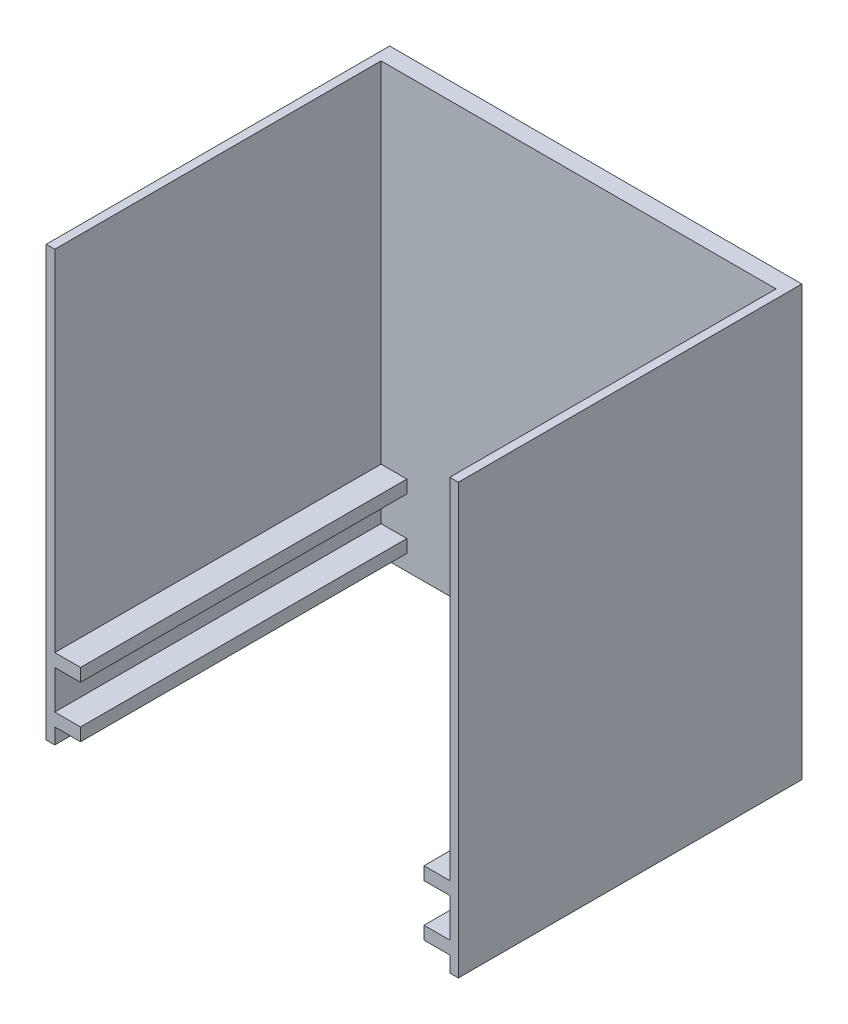
ISO-10303-21;
HEADER;
FILE_DESCRIPTION(('STEP AP214'),'2;1');
FILE_NAME('part.step','',(''),(''),'','','');
FILE_SCHEMA(('AUTOMOTIVE_DESIGN { 1 0 10303 214 1 1 1 1 }'));
ENDSEC;
DATA;
#1=APPLICATION_CONTEXT('core data for automotive mechanical design processes');
#2=APPLICATION_PROTOCOL_DEFINITION('international standard','automotive_design',2000,#1);
#3=PRODUCT_CONTEXT('',#1,'mechanical');
#4=PRODUCT('Part','Part','',(#3));
#5=PRODUCT_RELATED_PRODUCT_CATEGORY('part','',(#4));
#6=PRODUCT_DEFINITION_FORMATION('','',#4);
#7=PRODUCT_DEFINITION_CONTEXT('part definition',#1,'design');
#8=PRODUCT_DEFINITION('design','',#6,#7);
#9=PRODUCT_DEFINITION_SHAPE('','',#8);
#10=(LENGTH_UNIT() NAMED_UNIT(*) SI_UNIT(.MILLI.,.METRE.));
#11=(NAMED_UNIT(*) PLANE_ANGLE_UNIT() SI_UNIT($,.RADIAN.));
#12=(NAMED_UNIT(*) SI_UNIT($,.STERADIAN.) SOLID_ANGLE_UNIT());
#13=UNCERTAINTY_MEASURE_WITH_UNIT(LENGTH_MEASURE(1.E-05),#10,'distance_accuracy_value','');
#14=(GEOMETRIC_REPRESENTATION_CONTEXT(3) GLOBAL_UNCERTAINTY_ASSIGNED_CONTEXT((#13)) GLOBAL_UNIT_ASSIGNED_CONTEXT((#10,
#11,#12)) REPRESENTATION_CONTEXT('',''));
#15=CARTESIAN_POINT('',(0.,0.,0.));
#16=DIRECTION('',(0.,0.,1.));
#17=DIRECTION('',(1.,0.,0.));
#18=AXIS2_PLACEMENT_3D('',#15,#16,#17);
#19=CARTESIAN_POINT('',(0.,0.,40.));
#20=DIRECTION('',(0.,0.,-1.));
#21=DIRECTION('',(-1.,0.,0.));
#22=AXIS2_PLACEMENT_3D('',#19,#20,#21);
#23=PLANE('',#22);
#24=DIRECTION('',(1.,0.,0.));
#25=VECTOR('',#24,1.);
#26=CARTESIAN_POINT('',(-24.,-22.3221146069401,40.));
#27=LINE('',#26,#25);
#28=CARTESIAN_POINT('',(-24.,-22.3221146069401,40.));
#29=VERTEX_POINT('',#28);
#30=CARTESIAN_POINT('',(-23.,-22.3221146069401,40.));
#31=VERTEX_POINT('',#30);
#32=EDGE_CURVE('E439',#29,#31,#27,.T.);
#33=ORIENTED_EDGE('',*,*,#32,.T.);
#34=DIRECTION('',(0.,-1.,0.));
#35=VECTOR('',#34,1.);
#36=CARTESIAN_POINT('',(-23.,0.,40.));
#37=LINE('',#36,#35);
#38=CARTESIAN_POINT('',(-23.,-20.5,40.));
#39=VERTEX_POINT('',#38);
#40=EDGE_CURVE('E362',#39,#31,#37,.T.);
#41=ORIENTED_EDGE('',*,*,#40,.F.);
#42=DIRECTION('',(-1.,0.,0.));
#43=VECTOR('',#42,1.);
#44=CARTESIAN_POINT('',(0.,-20.5,40.));
#45=LINE('',#44,#43);
#46=CARTESIAN_POINT('',(-20.,-20.5,40.));
#47=VERTEX_POINT('',#46);
#48=EDGE_CURVE('E358',#47,#39,#45,.T.);
#49=ORIENTED_EDGE('',*,*,#48,.F.);
#50=DIRECTION('',(0.,-1.,0.));
#51=VECTOR('',#50,1.);
#52=CARTESIAN_POINT('',(-20.,0.,40.));
#53=LINE('',#52,#51);
#54=CARTESIAN_POINT('',(-20.,-19.,40.));
#55=VERTEX_POINT('',#54);
#56=EDGE_CURVE('E354',#55,#47,#53,.T.);
#57=ORIENTED_EDGE('',*,*,#56,.F.);
#58=DIRECTION('',(1.,0.,0.));
#59=VECTOR('',#58,1.);
#60=CARTESIAN_POINT('',(0.,-19.,40.));
#61=LINE('',#60,#59);
#62=CARTESIAN_POINT('',(-23.,-19.,40.));
#63=VERTEX_POINT('',#62);
#64=EDGE_CURVE('E350',#63,#55,#61,.T.);
#65=ORIENTED_EDGE('',*,*,#64,.F.);
#66=DIRECTION('',(0.,-1.,0.));
#67=VECTOR('',#66,1.);
#68=CARTESIAN_POINT('',(-23.,0.,40.));
#69=LINE('',#68,#67);
#70=CARTESIAN_POINT('',(-23.,-14.5,40.));
#71=VERTEX_POINT('',#70);
#72=EDGE_CURVE('E346',#71,#63,#69,.T.);
#73=ORIENTED_EDGE('',*,*,#72,.F.);
#74=DIRECTION('',(-1.,0.,0.));
#75=VECTOR('',#74,1.);
#76=CARTESIAN_POINT('',(0.,-14.5,40.));
#77=LINE('',#76,#75);
#78=CARTESIAN_POINT('',(-20.,-14.5,40.));
#79=VERTEX_POINT('',#78);
#80=EDGE_CURVE('E342',#79,#71,#77,.T.);
#81=ORIENTED_EDGE('',*,*,#80,.F.);
#82=DIRECTION('',(0.,-1.,0.));
#83=VECTOR('',#82,1.);
#84=CARTESIAN_POINT('',(-20.,0.,40.));
#85=LINE('',#84,#83);
#86=CARTESIAN_POINT('',(-20.,-13.,40.));
#87=VERTEX_POINT('',#86);
#88=EDGE_CURVE('E338',#87,#79,#85,.T.);
#89=ORIENTED_EDGE('',*,*,#88,.F.);
#90=DIRECTION('',(1.,0.,0.));
#91=VECTOR('',#90,1.);
#92=CARTESIAN_POINT('',(0.,-13.,40.));
#93=LINE('',#92,#91);
#94=CARTESIAN_POINT('',(-23.,-13.,40.));
#95=VERTEX_POINT('',#94);
#96=EDGE_CURVE('E334',#95,#87,#93,.T.);
#97=ORIENTED_EDGE('',*,*,#96,.F.);
#98=DIRECTION('',(0.,-1.,0.));
#99=VECTOR('',#98,1.);
#100=CARTESIAN_POINT('',(-23.,0.,40.));
#101=LINE('',#100,#99);
#102=CARTESIAN_POINT('',(-23.,27.67788539306,40.));
#103=VERTEX_POINT('',#102);
#104=EDGE_CURVE('E330',#103,#95,#101,.T.);
#105=ORIENTED_EDGE('',*,*,#104,.F.);
#106=DIRECTION('',(-1.,0.,0.));
#107=VECTOR('',#106,1.);
#108=CARTESIAN_POINT('',(-24.,27.6778853930599,40.));
#109=LINE('',#108,#107);
#110=CARTESIAN_POINT('',(-24.,27.6778853930599,40.));
#111=VERTEX_POINT('',#110);
#112=EDGE_CURVE('E433',#103,#111,#109,.T.);
#113=ORIENTED_EDGE('',*,*,#112,.T.);
#114=DIRECTION('',(0.,-1.,0.));
#115=VECTOR('',#114,1.);
#116=CARTESIAN_POINT('',(-24.,-22.3221146069401,40.));
#117=LINE('',#116,#115);
#118=EDGE_CURVE('E436',#111,#29,#117,.T.);
#119=ORIENTED_EDGE('',*,*,#118,.T.);
#120=EDGE_LOOP('',(#33,#41,#49,#57,#65,#73,#81,#89,#97,#105,#113,#119));
#121=FACE_BOUND('',#120,.T.);
#122=ADVANCED_FACE('F39',(#121),#23,.F.);
#123=CARTESIAN_POINT('',(24.,-22.3221146069401,40.));
#124=DIRECTION('',(-1.,0.,0.));
#125=DIRECTION('',(0.,0.,1.));
#126=AXIS2_PLACEMENT_3D('',#123,#124,#125);
#127=PLANE('',#126);
#128=DIRECTION('',(0.,1.,0.));
#129=VECTOR('',#128,1.);
#130=CARTESIAN_POINT('',(24.,-22.3221146069401,0.));
#131=LINE('',#130,#129);
#132=CARTESIAN_POINT('',(24.,-22.3221146069401,0.));
#133=VERTEX_POINT('',#132);
#134=CARTESIAN_POINT('',(24.,27.67788539306,0.));
#135=VERTEX_POINT('',#134);
#136=EDGE_CURVE('E375',#133,#135,#131,.T.);
#137=ORIENTED_EDGE('',*,*,#136,.T.);
#138=DIRECTION('',(0.,0.,-1.));
#139=VECTOR('',#138,1.);
#140=CARTESIAN_POINT('',(24.,27.67788539306,40.));
#141=LINE('',#140,#139);
#142=CARTESIAN_POINT('',(24.,27.67788539306,40.));
#143=VERTEX_POINT('',#142);
#144=EDGE_CURVE('E11',#143,#135,#141,.T.);
#145=ORIENTED_EDGE('',*,*,#144,.F.);
#146=DIRECTION('',(0.,1.,0.));
#147=VECTOR('',#146,1.);
#148=CARTESIAN_POINT('',(24.,-22.3221146069401,40.));
#149=LINE('',#148,#147);
#150=CARTESIAN_POINT('',(24.,-22.3221146069401,40.));
#151=VERTEX_POINT('',#150);
#152=EDGE_CURVE('E430',#151,#143,#149,.T.);
#153=ORIENTED_EDGE('',*,*,#152,.F.);
#154=DIRECTION('',(0.,0.,-1.));
#155=VECTOR('',#154,1.);
#156=CARTESIAN_POINT('',(24.,-22.3221146069401,40.));
#157=LINE('',#156,#155);
#158=EDGE_CURVE('E443',#151,#133,#157,.T.);
#159=ORIENTED_EDGE('',*,*,#158,.T.);
#160=EDGE_LOOP('',(#137,#145,#153,#159));
#161=FACE_BOUND('',#160,.T.);
#162=ADVANCED_FACE('F41',(#161),#127,.F.);
#163=CARTESIAN_POINT('',(-24.,27.6778853930599,40.));
#164=DIRECTION('',(0.,-1.,0.));
#165=DIRECTION('',(1.,0.,0.));
#166=AXIS2_PLACEMENT_3D('',#163,#164,#165);
#167=PLANE('',#166);
#168=ORIENTED_EDGE('',*,*,#112,.F.);
#169=DIRECTION('',(0.,0.,1.));
#170=VECTOR('',#169,1.);
#171=CARTESIAN_POINT('',(-23.,27.67788539306,2.));
#172=LINE('',#171,#170);
#173=CARTESIAN_POINT('',(-23.,27.67788539306,2.));
#174=VERTEX_POINT('',#173);
#175=EDGE_CURVE('E413',#174,#103,#172,.T.);
#176=ORIENTED_EDGE('',*,*,#175,.F.);
#177=DIRECTION('',(-1.,0.,0.));
#178=VECTOR('',#177,1.);
#179=CARTESIAN_POINT('',(0.,27.67788539306,2.));
#180=LINE('',#179,#178);
#181=CARTESIAN_POINT('',(23.,27.67788539306,2.));
#182=VERTEX_POINT('',#181);
#183=EDGE_CURVE('E257',#182,#174,#180,.T.);
#184=ORIENTED_EDGE('',*,*,#183,.F.);
#185=DIRECTION('',(0.,0.,1.));
#186=VECTOR('',#185,1.);
#187=CARTESIAN_POINT('',(23.,27.67788539306,2.));
#188=LINE('',#187,#186);
#189=CARTESIAN_POINT('',(23.,27.67788539306,40.));
#190=VERTEX_POINT('',#189);
#191=EDGE_CURVE('E416',#182,#190,#188,.T.);
#192=ORIENTED_EDGE('',*,*,#191,.T.);
#193=EDGE_CURVE('E93',#143,#190,#109,.T.);
#194=ORIENTED_EDGE('',*,*,#193,.F.);
#195=ORIENTED_EDGE('',*,*,#144,.T.);
#196=DIRECTION('',(-1.,0.,0.));
#197=VECTOR('',#196,1.);
#198=CARTESIAN_POINT('',(-24.,27.6778853930599,0.));
#199=LINE('',#198,#197);
#200=CARTESIAN_POINT('',(-24.,27.6778853930599,0.));
#201=VERTEX_POINT('',#200);
#202=EDGE_CURVE('E447',#135,#201,#199,.T.);
#203=ORIENTED_EDGE('',*,*,#202,.T.);
#204=DIRECTION('',(0.,0.,-1.));
#205=VECTOR('',#204,1.);
#206=CARTESIAN_POINT('',(-24.,27.6778853930599,40.));
#207=LINE('',#206,#205);
#208=EDGE_CURVE('E48',#111,#201,#207,.T.);
#209=ORIENTED_EDGE('',*,*,#208,.F.);
#210=EDGE_LOOP('',(#168,#176,#184,#192,#194,#195,#203,#209));
#211=FACE_BOUND('',#210,.T.);
#212=ADVANCED_FACE('F483',(#211),#167,.F.);
#213=CARTESIAN_POINT('',(-24.,-22.3221146069401,40.));
#214=DIRECTION('',(1.,0.,0.));
#215=DIRECTION('',(0.,0.,-1.));
#216=AXIS2_PLACEMENT_3D('',#213,#214,#215);
#217=PLANE('',#216);
#218=DIRECTION('',(0.,-1.,0.));
#219=VECTOR('',#218,1.);
#220=CARTESIAN_POINT('',(-24.,-22.3221146069401,0.));
#221=LINE('',#220,#219);
#222=CARTESIAN_POINT('',(-24.,-22.3221146069401,0.));
#223=VERTEX_POINT('',#222);
#224=EDGE_CURVE('E450',#201,#223,#221,.T.);
#225=ORIENTED_EDGE('',*,*,#224,.T.);
#226=DIRECTION('',(0.,0.,-1.));
#227=VECTOR('',#226,1.);
#228=CARTESIAN_POINT('',(-24.,-22.3221146069401,40.));
#229=LINE('',#228,#227);
#230=EDGE_CURVE('E457',#29,#223,#229,.T.);
#231=ORIENTED_EDGE('',*,*,#230,.F.);
#232=ORIENTED_EDGE('',*,*,#118,.F.);
#233=ORIENTED_EDGE('',*,*,#208,.T.);
#234=EDGE_LOOP('',(#225,#231,#232,#233));
#235=FACE_BOUND('',#234,.T.);
#236=ADVANCED_FACE('F465',(#235),#217,.F.);
#237=CARTESIAN_POINT('',(-24.,-22.3221146069401,40.));
#238=DIRECTION('',(0.,1.,0.));
#239=DIRECTION('',(0.,0.,1.));
#240=AXIS2_PLACEMENT_3D('',#237,#238,#239);
#241=PLANE('',#240);
#242=CARTESIAN_POINT('',(23.,-22.3221146069401,40.));
#243=VERTEX_POINT('',#242);
#244=EDGE_CURVE('E64',#243,#151,#27,.T.);
#245=ORIENTED_EDGE('',*,*,#244,.F.);
#246=DIRECTION('',(0.,0.,1.));
#247=VECTOR('',#246,1.);
#248=CARTESIAN_POINT('',(23.,-22.3221146069401,2.));
#249=LINE('',#248,#247);
#250=CARTESIAN_POINT('',(23.,-22.3221146069401,2.));
#251=VERTEX_POINT('',#250);
#252=EDGE_CURVE('E382',#251,#243,#249,.T.);
#253=ORIENTED_EDGE('',*,*,#252,.F.);
#254=DIRECTION('',(1.,0.,0.));
#255=VECTOR('',#254,1.);
#256=CARTESIAN_POINT('',(0.,-22.3221146069401,2.));
#257=LINE('',#256,#255);
#258=CARTESIAN_POINT('',(-23.,-22.3221146069401,2.));
#259=VERTEX_POINT('',#258);
#260=EDGE_CURVE('E297',#259,#251,#257,.T.);
#261=ORIENTED_EDGE('',*,*,#260,.F.);
#262=DIRECTION('',(0.,0.,1.));
#263=VECTOR('',#262,1.);
#264=CARTESIAN_POINT('',(-23.,-22.3221146069401,2.));
#265=LINE('',#264,#263);
#266=EDGE_CURVE('E385',#259,#31,#265,.T.);
#267=ORIENTED_EDGE('',*,*,#266,.T.);
#268=ORIENTED_EDGE('',*,*,#32,.F.);
#269=ORIENTED_EDGE('',*,*,#230,.T.);
#270=DIRECTION('',(1.,0.,0.));
#271=VECTOR('',#270,1.);
#272=CARTESIAN_POINT('',(-24.,-22.3221146069401,0.));
#273=LINE('',#272,#271);
#274=EDGE_CURVE('E86',#223,#133,#273,.T.);
#275=ORIENTED_EDGE('',*,*,#274,.T.);
#276=ORIENTED_EDGE('',*,*,#158,.F.);
#277=EDGE_LOOP('',(#245,#253,#261,#267,#268,#269,#275,#276));
#278=FACE_BOUND('',#277,.T.);
#279=ADVANCED_FACE('F474',(#278),#241,.F.);
#280=DIRECTION('',(-1.,0.,0.));
#281=VECTOR('',#280,1.);
#282=CARTESIAN_POINT('',(0.,-20.5,40.));
#283=LINE('',#282,#281);
#284=CARTESIAN_POINT('',(23.,-20.5,40.));
#285=VERTEX_POINT('',#284);
#286=CARTESIAN_POINT('',(20.,-20.5,40.));
#287=VERTEX_POINT('',#286);
#288=EDGE_CURVE('E240',#285,#287,#283,.T.);
#289=ORIENTED_EDGE('',*,*,#288,.F.);
#290=DIRECTION('',(0.,1.,0.));
#291=VECTOR('',#290,1.);
#292=CARTESIAN_POINT('',(23.,0.,40.));
#293=LINE('',#292,#291);
#294=EDGE_CURVE('E365',#243,#285,#293,.T.);
#295=ORIENTED_EDGE('',*,*,#294,.F.);
#296=ORIENTED_EDGE('',*,*,#244,.T.);
#297=ORIENTED_EDGE('',*,*,#152,.T.);
#298=ORIENTED_EDGE('',*,*,#193,.T.);
#299=DIRECTION('',(0.,1.,0.));
#300=VECTOR('',#299,1.);
#301=CARTESIAN_POINT('',(23.,0.,40.));
#302=LINE('',#301,#300);
#303=CARTESIAN_POINT('',(23.,-13.,40.));
#304=VERTEX_POINT('',#303);
#305=EDGE_CURVE('E327',#304,#190,#302,.T.);
#306=ORIENTED_EDGE('',*,*,#305,.F.);
#307=DIRECTION('',(1.,0.,0.));
#308=VECTOR('',#307,1.);
#309=CARTESIAN_POINT('',(0.,-13.,40.));
#310=LINE('',#309,#308);
#311=CARTESIAN_POINT('',(20.,-13.,40.));
#312=VERTEX_POINT('',#311);
#313=EDGE_CURVE('E323',#312,#304,#310,.T.);
#314=ORIENTED_EDGE('',*,*,#313,.F.);
#315=DIRECTION('',(0.,1.,0.));
#316=VECTOR('',#315,1.);
#317=CARTESIAN_POINT('',(20.,0.,40.));
#318=LINE('',#317,#316);
#319=CARTESIAN_POINT('',(20.,-14.5,40.));
#320=VERTEX_POINT('',#319);
#321=EDGE_CURVE('E319',#320,#312,#318,.T.);
#322=ORIENTED_EDGE('',*,*,#321,.F.);
#323=DIRECTION('',(-1.,0.,0.));
#324=VECTOR('',#323,1.);
#325=CARTESIAN_POINT('',(0.,-14.5,40.));
#326=LINE('',#325,#324);
#327=CARTESIAN_POINT('',(23.,-14.5,40.));
#328=VERTEX_POINT('',#327);
#329=EDGE_CURVE('E315',#328,#320,#326,.T.);
#330=ORIENTED_EDGE('',*,*,#329,.F.);
#331=DIRECTION('',(0.,1.,0.));
#332=VECTOR('',#331,1.);
#333=CARTESIAN_POINT('',(23.,0.,40.));
#334=LINE('',#333,#332);
#335=CARTESIAN_POINT('',(23.,-19.,40.));
#336=VERTEX_POINT('',#335);
#337=EDGE_CURVE('E312',#336,#328,#334,.T.);
#338=ORIENTED_EDGE('',*,*,#337,.F.);
#339=DIRECTION('',(1.,0.,0.));
#340=VECTOR('',#339,1.);
#341=CARTESIAN_POINT('',(0.,-19.,40.));
#342=LINE('',#341,#340);
#343=CARTESIAN_POINT('',(20.,-19.,40.));
#344=VERTEX_POINT('',#343);
#345=EDGE_CURVE('E55',#344,#336,#342,.T.);
#346=ORIENTED_EDGE('',*,*,#345,.F.);
#347=DIRECTION('',(0.,1.,0.));
#348=VECTOR('',#347,1.);
#349=CARTESIAN_POINT('',(20.,0.,40.));
#350=LINE('',#349,#348);
#351=EDGE_CURVE('E236',#287,#344,#350,.T.);
#352=ORIENTED_EDGE('',*,*,#351,.F.);
#353=EDGE_LOOP('',(#289,#295,#296,#297,#298,#306,#314,#322,#330,#338,#346,#352));
#354=FACE_BOUND('',#353,.T.);
#355=ADVANCED_FACE('F494',(#354),#23,.F.);
#356=CARTESIAN_POINT('',(0.,0.,0.));
#357=DIRECTION('',(0.,0.,-1.));
#358=DIRECTION('',(-1.,0.,0.));
#359=AXIS2_PLACEMENT_3D('',#356,#357,#358);
#360=PLANE('',#359);
#361=ORIENTED_EDGE('',*,*,#136,.F.);
#362=ORIENTED_EDGE('',*,*,#274,.F.);
#363=ORIENTED_EDGE('',*,*,#224,.F.);
#364=ORIENTED_EDGE('',*,*,#202,.F.);
#365=EDGE_LOOP('',(#361,#362,#363,#364));
#366=FACE_BOUND('',#365,.T.);
#367=ADVANCED_FACE('F470',(#366),#360,.T.);
#368=CARTESIAN_POINT('',(0.,-19.,2.));
#369=DIRECTION('',(0.,-1.,0.));
#370=DIRECTION('',(0.,0.,-1.));
#371=AXIS2_PLACEMENT_3D('',#368,#369,#370);
#372=PLANE('',#371);
#373=ORIENTED_EDGE('',*,*,#345,.T.);
#374=DIRECTION('',(0.,0.,1.));
#375=VECTOR('',#374,1.);
#376=CARTESIAN_POINT('',(23.,-19.,2.));
#377=LINE('',#376,#375);
#378=CARTESIAN_POINT('',(23.,-19.,2.));
#379=VERTEX_POINT('',#378);
#380=EDGE_CURVE('E210',#379,#336,#377,.T.);
#381=ORIENTED_EDGE('',*,*,#380,.F.);
#382=DIRECTION('',(1.,0.,0.));
#383=VECTOR('',#382,1.);
#384=CARTESIAN_POINT('',(0.,-19.,2.));
#385=LINE('',#384,#383);
#386=CARTESIAN_POINT('',(20.,-19.,2.));
#387=VERTEX_POINT('',#386);
#388=EDGE_CURVE('E214',#387,#379,#385,.T.);
#389=ORIENTED_EDGE('',*,*,#388,.F.);
#390=DIRECTION('',(0.,0.,1.));
#391=VECTOR('',#390,1.);
#392=CARTESIAN_POINT('',(20.,-19.,2.));
#393=LINE('',#392,#391);
#394=EDGE_CURVE('E372',#387,#344,#393,.T.);
#395=ORIENTED_EDGE('',*,*,#394,.T.);
#396=EDGE_LOOP('',(#373,#381,#389,#395));
#397=FACE_BOUND('',#396,.T.);
#398=ADVANCED_FACE('F212',(#397),#372,.F.);
#399=CARTESIAN_POINT('',(20.,0.,2.));
#400=DIRECTION('',(1.,0.,0.));
#401=DIRECTION('',(0.,0.,-1.));
#402=AXIS2_PLACEMENT_3D('',#399,#400,#401);
#403=PLANE('',#402);
#404=ORIENTED_EDGE('',*,*,#351,.T.);
#405=ORIENTED_EDGE('',*,*,#394,.F.);
#406=DIRECTION('',(0.,1.,0.));
#407=VECTOR('',#406,1.);
#408=CARTESIAN_POINT('',(20.,0.,2.));
#409=LINE('',#408,#407);
#410=CARTESIAN_POINT('',(20.,-20.5,2.));
#411=VERTEX_POINT('',#410);
#412=EDGE_CURVE('E221',#411,#387,#409,.T.);
#413=ORIENTED_EDGE('',*,*,#412,.F.);
#414=DIRECTION('',(0.,0.,1.));
#415=VECTOR('',#414,1.);
#416=CARTESIAN_POINT('',(20.,-20.5,2.));
#417=LINE('',#416,#415);
#418=EDGE_CURVE('E376',#411,#287,#417,.T.);
#419=ORIENTED_EDGE('',*,*,#418,.T.);
#420=EDGE_LOOP('',(#404,#405,#413,#419));
#421=FACE_BOUND('',#420,.T.);
#422=ADVANCED_FACE('F507',(#421),#403,.F.);
#423=CARTESIAN_POINT('',(0.,-20.5,2.));
#424=DIRECTION('',(0.,1.,0.));
#425=DIRECTION('',(0.,0.,1.));
#426=AXIS2_PLACEMENT_3D('',#423,#424,#425);
#427=PLANE('',#426);
#428=ORIENTED_EDGE('',*,*,#288,.T.);
#429=ORIENTED_EDGE('',*,*,#418,.F.);
#430=DIRECTION('',(-1.,0.,0.));
#431=VECTOR('',#430,1.);
#432=CARTESIAN_POINT('',(0.,-20.5,2.));
#433=LINE('',#432,#431);
#434=CARTESIAN_POINT('',(23.,-20.5,2.));
#435=VERTEX_POINT('',#434);
#436=EDGE_CURVE('E305',#435,#411,#433,.T.);
#437=ORIENTED_EDGE('',*,*,#436,.F.);
#438=DIRECTION('',(0.,0.,1.));
#439=VECTOR('',#438,1.);
#440=CARTESIAN_POINT('',(23.,-20.5,2.));
#441=LINE('',#440,#439);
#442=EDGE_CURVE('E379',#435,#285,#441,.T.);
#443=ORIENTED_EDGE('',*,*,#442,.T.);
#444=EDGE_LOOP('',(#428,#429,#437,#443));
#445=FACE_BOUND('',#444,.T.);
#446=ADVANCED_FACE('F510',(#445),#427,.F.);
#447=CARTESIAN_POINT('',(23.,0.,2.));
#448=DIRECTION('',(1.,0.,0.));
#449=DIRECTION('',(0.,0.,-1.));
#450=AXIS2_PLACEMENT_3D('',#447,#448,#449);
#451=PLANE('',#450);
#452=ORIENTED_EDGE('',*,*,#294,.T.);
#453=ORIENTED_EDGE('',*,*,#442,.F.);
#454=DIRECTION('',(0.,1.,0.));
#455=VECTOR('',#454,1.);
#456=CARTESIAN_POINT('',(23.,0.,2.));
#457=LINE('',#456,#455);
#458=EDGE_CURVE('E301',#251,#435,#457,.T.);
#459=ORIENTED_EDGE('',*,*,#458,.F.);
#460=ORIENTED_EDGE('',*,*,#252,.T.);
#461=EDGE_LOOP('',(#452,#453,#459,#460));
#462=FACE_BOUND('',#461,.T.);
#463=ADVANCED_FACE('F512',(#462),#451,.F.);
#464=CARTESIAN_POINT('',(-23.,0.,2.));
#465=DIRECTION('',(-1.,0.,0.));
#466=DIRECTION('',(0.,0.,1.));
#467=AXIS2_PLACEMENT_3D('',#464,#465,#466);
#468=PLANE('',#467);
#469=ORIENTED_EDGE('',*,*,#40,.T.);
#470=ORIENTED_EDGE('',*,*,#266,.F.);
#471=DIRECTION('',(0.,-1.,0.));
#472=VECTOR('',#471,1.);
#473=CARTESIAN_POINT('',(-23.,0.,2.));
#474=LINE('',#473,#472);
#475=CARTESIAN_POINT('',(-23.,-20.5,2.));
#476=VERTEX_POINT('',#475);
#477=EDGE_CURVE('E293',#476,#259,#474,.T.);
#478=ORIENTED_EDGE('',*,*,#477,.F.);
#479=DIRECTION('',(0.,0.,1.));
#480=VECTOR('',#479,1.);
#481=CARTESIAN_POINT('',(-23.,-20.5,2.));
#482=LINE('',#481,#480);
#483=EDGE_CURVE('E389',#476,#39,#482,.T.);
#484=ORIENTED_EDGE('',*,*,#483,.T.);
#485=EDGE_LOOP('',(#469,#470,#478,#484));
#486=FACE_BOUND('',#485,.T.);
#487=ADVANCED_FACE('F519',(#486),#468,.F.);
#488=CARTESIAN_POINT('',(0.,-20.5,2.));
#489=DIRECTION('',(0.,1.,0.));
#490=DIRECTION('',(0.,0.,1.));
#491=AXIS2_PLACEMENT_3D('',#488,#489,#490);
#492=PLANE('',#491);
#493=ORIENTED_EDGE('',*,*,#48,.T.);
#494=ORIENTED_EDGE('',*,*,#483,.F.);
#495=DIRECTION('',(-1.,0.,0.));
#496=VECTOR('',#495,1.);
#497=CARTESIAN_POINT('',(0.,-20.5,2.));
#498=LINE('',#497,#496);
#499=CARTESIAN_POINT('',(-20.,-20.5,2.));
#500=VERTEX_POINT('',#499);
#501=EDGE_CURVE('E289',#500,#476,#498,.T.);
#502=ORIENTED_EDGE('',*,*,#501,.F.);
#503=DIRECTION('',(0.,0.,1.));
#504=VECTOR('',#503,1.);
#505=CARTESIAN_POINT('',(-20.,-20.5,2.));
#506=LINE('',#505,#504);
#507=EDGE_CURVE('E392',#500,#47,#506,.T.);
#508=ORIENTED_EDGE('',*,*,#507,.T.);
#509=EDGE_LOOP('',(#493,#494,#502,#508));
#510=FACE_BOUND('',#509,.T.);
#511=ADVANCED_FACE('F522',(#510),#492,.F.);
#512=CARTESIAN_POINT('',(-20.,0.,2.));
#513=DIRECTION('',(-1.,0.,0.));
#514=DIRECTION('',(0.,0.,1.));
#515=AXIS2_PLACEMENT_3D('',#512,#513,#514);
#516=PLANE('',#515);
#517=ORIENTED_EDGE('',*,*,#56,.T.);
#518=ORIENTED_EDGE('',*,*,#507,.F.);
#519=DIRECTION('',(0.,-1.,0.));
#520=VECTOR('',#519,1.);
#521=CARTESIAN_POINT('',(-20.,0.,2.));
#522=LINE('',#521,#520);
#523=CARTESIAN_POINT('',(-20.,-19.,2.));
#524=VERTEX_POINT('',#523);
#525=EDGE_CURVE('E285',#524,#500,#522,.T.);
#526=ORIENTED_EDGE('',*,*,#525,.F.);
#527=DIRECTION('',(0.,0.,1.));
#528=VECTOR('',#527,1.);
#529=CARTESIAN_POINT('',(-20.,-19.,2.));
#530=LINE('',#529,#528);
#531=EDGE_CURVE('E395',#524,#55,#530,.T.);
#532=ORIENTED_EDGE('',*,*,#531,.T.);
#533=EDGE_LOOP('',(#517,#518,#526,#532));
#534=FACE_BOUND('',#533,.T.);
#535=ADVANCED_FACE('F525',(#534),#516,.F.);
#536=CARTESIAN_POINT('',(0.,-19.,2.));
#537=DIRECTION('',(0.,-1.,0.));
#538=DIRECTION('',(0.,0.,-1.));
#539=AXIS2_PLACEMENT_3D('',#536,#537,#538);
#540=PLANE('',#539);
#541=ORIENTED_EDGE('',*,*,#64,.T.);
#542=ORIENTED_EDGE('',*,*,#531,.F.);
#543=DIRECTION('',(1.,0.,0.));
#544=VECTOR('',#543,1.);
#545=CARTESIAN_POINT('',(0.,-19.,2.));
#546=LINE('',#545,#544);
#547=CARTESIAN_POINT('',(-23.,-19.,2.));
#548=VERTEX_POINT('',#547);
#549=EDGE_CURVE('E281',#548,#524,#546,.T.);
#550=ORIENTED_EDGE('',*,*,#549,.F.);
#551=DIRECTION('',(0.,0.,1.));
#552=VECTOR('',#551,1.);
#553=CARTESIAN_POINT('',(-23.,-19.,2.));
#554=LINE('',#553,#552);
#555=EDGE_CURVE('E398',#548,#63,#554,.T.);
#556=ORIENTED_EDGE('',*,*,#555,.T.);
#557=EDGE_LOOP('',(#541,#542,#550,#556));
#558=FACE_BOUND('',#557,.T.);
#559=ADVANCED_FACE('F530',(#558),#540,.F.);
#560=CARTESIAN_POINT('',(-23.,0.,2.));
#561=DIRECTION('',(-1.,0.,0.));
#562=DIRECTION('',(0.,0.,1.));
#563=AXIS2_PLACEMENT_3D('',#560,#561,#562);
#564=PLANE('',#563);
#565=ORIENTED_EDGE('',*,*,#72,.T.);
#566=ORIENTED_EDGE('',*,*,#555,.F.);
#567=DIRECTION('',(0.,-1.,0.));
#568=VECTOR('',#567,1.);
#569=CARTESIAN_POINT('',(-23.,0.,2.));
#570=LINE('',#569,#568);
#571=CARTESIAN_POINT('',(-23.,-14.5,2.));
#572=VERTEX_POINT('',#571);
#573=EDGE_CURVE('E277',#572,#548,#570,.T.);
#574=ORIENTED_EDGE('',*,*,#573,.F.);
#575=DIRECTION('',(0.,0.,1.));
#576=VECTOR('',#575,1.);
#577=CARTESIAN_POINT('',(-23.,-14.5,2.));
#578=LINE('',#577,#576);
#579=EDGE_CURVE('E401',#572,#71,#578,.T.);
#580=ORIENTED_EDGE('',*,*,#579,.T.);
#581=EDGE_LOOP('',(#565,#566,#574,#580));
#582=FACE_BOUND('',#581,.T.);
#583=ADVANCED_FACE('F534',(#582),#564,.F.);
#584=CARTESIAN_POINT('',(0.,-14.5,2.));
#585=DIRECTION('',(0.,1.,0.));
#586=DIRECTION('',(0.,0.,1.));
#587=AXIS2_PLACEMENT_3D('',#584,#585,#586);
#588=PLANE('',#587);
#589=ORIENTED_EDGE('',*,*,#80,.T.);
#590=ORIENTED_EDGE('',*,*,#579,.F.);
#591=DIRECTION('',(-1.,0.,0.));
#592=VECTOR('',#591,1.);
#593=CARTESIAN_POINT('',(0.,-14.5,2.));
#594=LINE('',#593,#592);
#595=CARTESIAN_POINT('',(-20.,-14.5,2.));
#596=VERTEX_POINT('',#595);
#597=EDGE_CURVE('E273',#596,#572,#594,.T.);
#598=ORIENTED_EDGE('',*,*,#597,.F.);
#599=DIRECTION('',(0.,0.,1.));
#600=VECTOR('',#599,1.);
#601=CARTESIAN_POINT('',(-20.,-14.5,2.));
#602=LINE('',#601,#600);
#603=EDGE_CURVE('E404',#596,#79,#602,.T.);
#604=ORIENTED_EDGE('',*,*,#603,.T.);
#605=EDGE_LOOP('',(#589,#590,#598,#604));
#606=FACE_BOUND('',#605,.T.);
#607=ADVANCED_FACE('F537',(#606),#588,.F.);
#608=CARTESIAN_POINT('',(-20.,0.,2.));
#609=DIRECTION('',(-1.,0.,0.));
#610=DIRECTION('',(0.,0.,1.));
#611=AXIS2_PLACEMENT_3D('',#608,#609,#610);
#612=PLANE('',#611);
#613=ORIENTED_EDGE('',*,*,#88,.T.);
#614=ORIENTED_EDGE('',*,*,#603,.F.);
#615=DIRECTION('',(0.,-1.,0.));
#616=VECTOR('',#615,1.);
#617=CARTESIAN_POINT('',(-20.,0.,2.));
#618=LINE('',#617,#616);
#619=CARTESIAN_POINT('',(-20.,-13.,2.));
#620=VERTEX_POINT('',#619);
#621=EDGE_CURVE('E269',#620,#596,#618,.T.);
#622=ORIENTED_EDGE('',*,*,#621,.F.);
#623=DIRECTION('',(0.,0.,1.));
#624=VECTOR('',#623,1.);
#625=CARTESIAN_POINT('',(-20.,-13.,2.));
#626=LINE('',#625,#624);
#627=EDGE_CURVE('E407',#620,#87,#626,.T.);
#628=ORIENTED_EDGE('',*,*,#627,.T.);
#629=EDGE_LOOP('',(#613,#614,#622,#628));
#630=FACE_BOUND('',#629,.T.);
#631=ADVANCED_FACE('F540',(#630),#612,.F.);
#632=CARTESIAN_POINT('',(0.,-13.,2.));
#633=DIRECTION('',(0.,-1.,0.));
#634=DIRECTION('',(0.,0.,-1.));
#635=AXIS2_PLACEMENT_3D('',#632,#633,#634);
#636=PLANE('',#635);
#637=ORIENTED_EDGE('',*,*,#96,.T.);
#638=ORIENTED_EDGE('',*,*,#627,.F.);
#639=DIRECTION('',(1.,0.,0.));
#640=VECTOR('',#639,1.);
#641=CARTESIAN_POINT('',(0.,-13.,2.));
#642=LINE('',#641,#640);
#643=CARTESIAN_POINT('',(-23.,-13.,2.));
#644=VERTEX_POINT('',#643);
#645=EDGE_CURVE('E265',#644,#620,#642,.T.);
#646=ORIENTED_EDGE('',*,*,#645,.F.);
#647=DIRECTION('',(0.,0.,1.));
#648=VECTOR('',#647,1.);
#649=CARTESIAN_POINT('',(-23.,-13.,2.));
#650=LINE('',#649,#648);
#651=EDGE_CURVE('E410',#644,#95,#650,.T.);
#652=ORIENTED_EDGE('',*,*,#651,.T.);
#653=EDGE_LOOP('',(#637,#638,#646,#652));
#654=FACE_BOUND('',#653,.T.);
#655=ADVANCED_FACE('F543',(#654),#636,.F.);
#656=CARTESIAN_POINT('',(-23.,0.,2.));
#657=DIRECTION('',(-1.,0.,0.));
#658=DIRECTION('',(0.,-1.,0.));
#659=AXIS2_PLACEMENT_3D('',#656,#657,#658);
#660=PLANE('',#659);
#661=ORIENTED_EDGE('',*,*,#104,.T.);
#662=ORIENTED_EDGE('',*,*,#651,.F.);
#663=DIRECTION('',(0.,-1.,0.));
#664=VECTOR('',#663,1.);
#665=CARTESIAN_POINT('',(-23.,0.,2.));
#666=LINE('',#665,#664);
#667=EDGE_CURVE('E261',#174,#644,#666,.T.);
#668=ORIENTED_EDGE('',*,*,#667,.F.);
#669=ORIENTED_EDGE('',*,*,#175,.T.);
#670=EDGE_LOOP('',(#661,#662,#668,#669));
#671=FACE_BOUND('',#670,.T.);
#672=ADVANCED_FACE('F486',(#671),#660,.F.);
#673=CARTESIAN_POINT('',(23.,0.,2.));
#674=DIRECTION('',(1.,0.,0.));
#675=DIRECTION('',(0.,0.,-1.));
#676=AXIS2_PLACEMENT_3D('',#673,#674,#675);
#677=PLANE('',#676);
#678=ORIENTED_EDGE('',*,*,#305,.T.);
#679=ORIENTED_EDGE('',*,*,#191,.F.);
#680=DIRECTION('',(0.,1.,0.));
#681=VECTOR('',#680,1.);
#682=CARTESIAN_POINT('',(23.,0.,2.));
#683=LINE('',#682,#681);
#684=CARTESIAN_POINT('',(23.,-13.,2.));
#685=VERTEX_POINT('',#684);
#686=EDGE_CURVE('E253',#685,#182,#683,.T.);
#687=ORIENTED_EDGE('',*,*,#686,.F.);
#688=DIRECTION('',(0.,0.,1.));
#689=VECTOR('',#688,1.);
#690=CARTESIAN_POINT('',(23.,-13.,2.));
#691=LINE('',#690,#689);
#692=EDGE_CURVE('E419',#685,#304,#691,.T.);
#693=ORIENTED_EDGE('',*,*,#692,.T.);
#694=EDGE_LOOP('',(#678,#679,#687,#693));
#695=FACE_BOUND('',#694,.T.);
#696=ADVANCED_FACE('F491',(#695),#677,.F.);
#697=CARTESIAN_POINT('',(0.,-13.,2.));
#698=DIRECTION('',(0.,-1.,0.));
#699=DIRECTION('',(0.,0.,-1.));
#700=AXIS2_PLACEMENT_3D('',#697,#698,#699);
#701=PLANE('',#700);
#702=ORIENTED_EDGE('',*,*,#313,.T.);
#703=ORIENTED_EDGE('',*,*,#692,.F.);
#704=DIRECTION('',(1.,0.,0.));
#705=VECTOR('',#704,1.);
#706=CARTESIAN_POINT('',(0.,-13.,2.));
#707=LINE('',#706,#705);
#708=CARTESIAN_POINT('',(20.,-13.,2.));
#709=VERTEX_POINT('',#708);
#710=EDGE_CURVE('E249',#709,#685,#707,.T.);
#711=ORIENTED_EDGE('',*,*,#710,.F.);
#712=DIRECTION('',(0.,0.,1.));
#713=VECTOR('',#712,1.);
#714=CARTESIAN_POINT('',(20.,-13.,2.));
#715=LINE('',#714,#713);
#716=EDGE_CURVE('E422',#709,#312,#715,.T.);
#717=ORIENTED_EDGE('',*,*,#716,.T.);
#718=EDGE_LOOP('',(#702,#703,#711,#717));
#719=FACE_BOUND('',#718,.T.);
#720=ADVANCED_FACE('F499',(#719),#701,.F.);
#721=CARTESIAN_POINT('',(20.,0.,2.));
#722=DIRECTION('',(1.,0.,0.));
#723=DIRECTION('',(0.,1.,0.));
#724=AXIS2_PLACEMENT_3D('',#721,#722,#723);
#725=PLANE('',#724);
#726=ORIENTED_EDGE('',*,*,#321,.T.);
#727=ORIENTED_EDGE('',*,*,#716,.F.);
#728=DIRECTION('',(0.,1.,0.));
#729=VECTOR('',#728,1.);
#730=CARTESIAN_POINT('',(20.,0.,2.));
#731=LINE('',#730,#729);
#732=CARTESIAN_POINT('',(20.,-14.5,2.));
#733=VERTEX_POINT('',#732);
#734=EDGE_CURVE('E245',#733,#709,#731,.T.);
#735=ORIENTED_EDGE('',*,*,#734,.F.);
#736=DIRECTION('',(0.,0.,1.));
#737=VECTOR('',#736,1.);
#738=CARTESIAN_POINT('',(20.,-14.5,2.));
#739=LINE('',#738,#737);
#740=EDGE_CURVE('E425',#733,#320,#739,.T.);
#741=ORIENTED_EDGE('',*,*,#740,.T.);
#742=EDGE_LOOP('',(#726,#727,#735,#741));
#743=FACE_BOUND('',#742,.T.);
#744=ADVANCED_FACE('F502',(#743),#725,.F.);
#745=CARTESIAN_POINT('',(0.,-14.5,2.));
#746=DIRECTION('',(0.,1.,0.));
#747=DIRECTION('',(-1.,0.,0.));
#748=AXIS2_PLACEMENT_3D('',#745,#746,#747);
#749=PLANE('',#748);
#750=ORIENTED_EDGE('',*,*,#329,.T.);
#751=ORIENTED_EDGE('',*,*,#740,.F.);
#752=DIRECTION('',(-1.,0.,0.));
#753=VECTOR('',#752,1.);
#754=CARTESIAN_POINT('',(0.,-14.5,2.));
#755=LINE('',#754,#753);
#756=CARTESIAN_POINT('',(23.,-14.5,2.));
#757=VERTEX_POINT('',#756);
#758=EDGE_CURVE('E230',#757,#733,#755,.T.);
#759=ORIENTED_EDGE('',*,*,#758,.F.);
#760=DIRECTION('',(0.,0.,1.));
#761=VECTOR('',#760,1.);
#762=CARTESIAN_POINT('',(23.,-14.5,2.));
#763=LINE('',#762,#761);
#764=EDGE_CURVE('E220',#757,#328,#763,.T.);
#765=ORIENTED_EDGE('',*,*,#764,.T.);
#766=EDGE_LOOP('',(#750,#751,#759,#765));
#767=FACE_BOUND('',#766,.T.);
#768=ADVANCED_FACE('F504',(#767),#749,.F.);
#769=CARTESIAN_POINT('',(23.,0.,2.));
#770=DIRECTION('',(1.,0.,0.));
#771=DIRECTION('',(0.,0.,-1.));
#772=AXIS2_PLACEMENT_3D('',#769,#770,#771);
#773=PLANE('',#772);
#774=ORIENTED_EDGE('',*,*,#337,.T.);
#775=ORIENTED_EDGE('',*,*,#764,.F.);
#776=DIRECTION('',(0.,1.,0.));
#777=VECTOR('',#776,1.);
#778=CARTESIAN_POINT('',(23.,0.,2.));
#779=LINE('',#778,#777);
#780=EDGE_CURVE('E224',#379,#757,#779,.T.);
#781=ORIENTED_EDGE('',*,*,#780,.F.);
#782=ORIENTED_EDGE('',*,*,#380,.T.);
#783=EDGE_LOOP('',(#774,#775,#781,#782));
#784=FACE_BOUND('',#783,.T.);
#785=ADVANCED_FACE('F225',(#784),#773,.F.);
#786=CARTESIAN_POINT('',(0.,0.,2.));
#787=DIRECTION('',(0.,0.,1.));
#788=DIRECTION('',(1.,0.,0.));
#789=AXIS2_PLACEMENT_3D('',#786,#787,#788);
#790=PLANE('',#789);
#791=ORIENTED_EDGE('',*,*,#388,.T.);
#792=ORIENTED_EDGE('',*,*,#780,.T.);
#793=ORIENTED_EDGE('',*,*,#758,.T.);
#794=ORIENTED_EDGE('',*,*,#734,.T.);
#795=ORIENTED_EDGE('',*,*,#710,.T.);
#796=ORIENTED_EDGE('',*,*,#686,.T.);
#797=ORIENTED_EDGE('',*,*,#183,.T.);
#798=ORIENTED_EDGE('',*,*,#667,.T.);
#799=ORIENTED_EDGE('',*,*,#645,.T.);
#800=ORIENTED_EDGE('',*,*,#621,.T.);
#801=ORIENTED_EDGE('',*,*,#597,.T.);
#802=ORIENTED_EDGE('',*,*,#573,.T.);
#803=ORIENTED_EDGE('',*,*,#549,.T.);
#804=ORIENTED_EDGE('',*,*,#525,.T.);
#805=ORIENTED_EDGE('',*,*,#501,.T.);
#806=ORIENTED_EDGE('',*,*,#477,.T.);
#807=ORIENTED_EDGE('',*,*,#260,.T.);
#808=ORIENTED_EDGE('',*,*,#458,.T.);
#809=ORIENTED_EDGE('',*,*,#436,.T.);
#810=ORIENTED_EDGE('',*,*,#412,.T.);
#811=EDGE_LOOP('',(#791,#792,#793,#794,#795,#796,#797,#798,#799,#800,#801,#802,#803,#804,#805,
#806,#807,#808,#809,#810));
#812=FACE_BOUND('',#811,.T.);
#813=ADVANCED_FACE('F232',(#812),#790,.T.);
#814=CLOSED_SHELL('',(#122,#162,#212,#236,#279,#355,#367,#398,#422,#446,#463,#487,#511,#535,
#559,#583,#607,#631,#655,#672,#696,#720,#744,#768,#785,#813));
#815=MANIFOLD_SOLID_BREP('B2',#814);
#816=ADVANCED_BREP_SHAPE_REPRESENTATION('',(#18,#815),#14);
#817=SHAPE_DEFINITION_REPRESENTATION(#9,#816);
ENDSEC;
END-ISO-10303-21;
